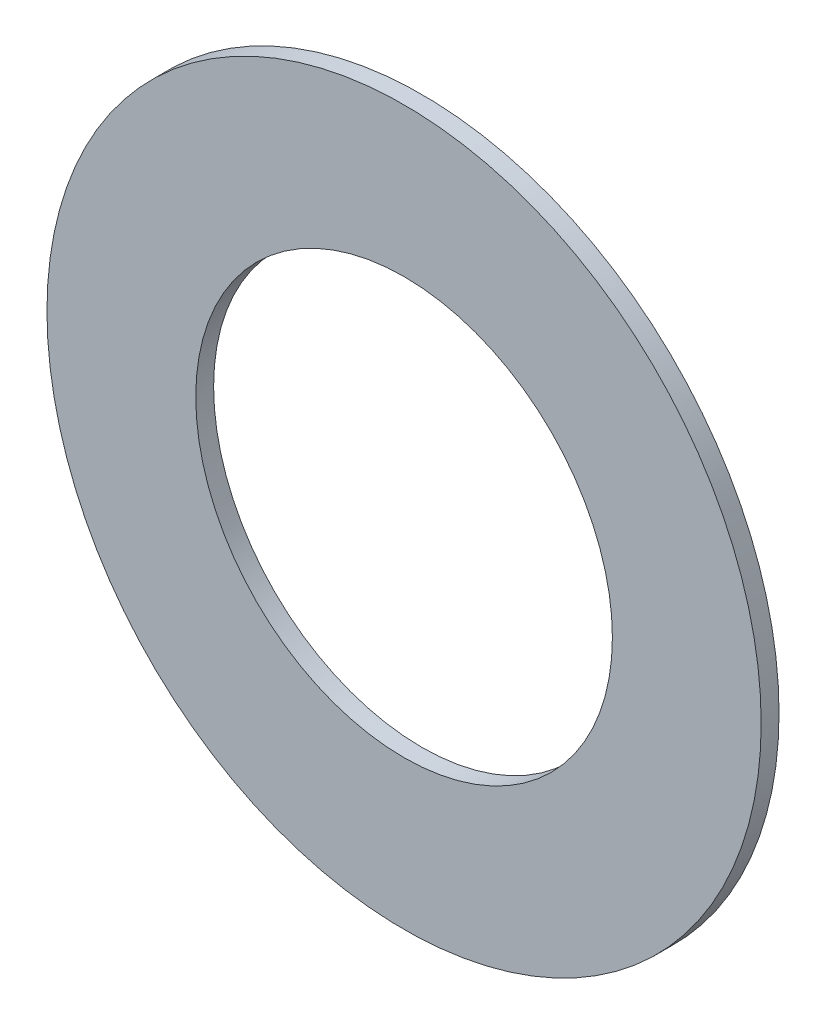
ISO-10303-21;
HEADER;
FILE_DESCRIPTION(('STEP AP214'),'2;1');
FILE_NAME('part.step','',(''),(''),'','','');
FILE_SCHEMA(('AUTOMOTIVE_DESIGN { 1 0 10303 214 1 1 1 1 }'));
ENDSEC;
DATA;
#1=APPLICATION_CONTEXT('core data for automotive mechanical design processes');
#2=APPLICATION_PROTOCOL_DEFINITION('international standard','automotive_design',2000,#1);
#3=PRODUCT_CONTEXT('',#1,'mechanical');
#4=PRODUCT('Part','Part','',(#3));
#5=PRODUCT_RELATED_PRODUCT_CATEGORY('part','',(#4));
#6=PRODUCT_DEFINITION_FORMATION('','',#4);
#7=PRODUCT_DEFINITION_CONTEXT('part definition',#1,'design');
#8=PRODUCT_DEFINITION('design','',#6,#7);
#9=PRODUCT_DEFINITION_SHAPE('','',#8);
#10=(LENGTH_UNIT() NAMED_UNIT(*) SI_UNIT(.MILLI.,.METRE.));
#11=(NAMED_UNIT(*) PLANE_ANGLE_UNIT() SI_UNIT($,.RADIAN.));
#12=(NAMED_UNIT(*) SI_UNIT($,.STERADIAN.) SOLID_ANGLE_UNIT());
#13=UNCERTAINTY_MEASURE_WITH_UNIT(LENGTH_MEASURE(1.E-05),#10,'distance_accuracy_value','');
#14=(GEOMETRIC_REPRESENTATION_CONTEXT(3) GLOBAL_UNCERTAINTY_ASSIGNED_CONTEXT((#13)) GLOBAL_UNIT_ASSIGNED_CONTEXT((#10,
#11,#12)) REPRESENTATION_CONTEXT('',''));
#15=CARTESIAN_POINT('',(0.,0.,0.));
#16=DIRECTION('',(0.,0.,1.));
#17=DIRECTION('',(1.,0.,0.));
#18=AXIS2_PLACEMENT_3D('',#15,#16,#17);
#19=CARTESIAN_POINT('',(0.,0.,0.3));
#20=DIRECTION('',(0.,0.,1.));
#21=DIRECTION('',(1.,0.,0.));
#22=AXIS2_PLACEMENT_3D('',#19,#20,#21);
#23=PLANE('',#22);
#24=CARTESIAN_POINT('',(0.,0.,0.3));
#25=DIRECTION('',(0.,0.,1.));
#26=DIRECTION('',(1.,0.,0.));
#27=AXIS2_PLACEMENT_3D('',#24,#25,#26);
#28=CIRCLE('',#27,6.);
#29=CARTESIAN_POINT('',(6.,0.,0.3));
#30=VERTEX_POINT('',#29);
#31=EDGE_CURVE('E10',#30,#30,#28,.T.);
#32=ORIENTED_EDGE('',*,*,#31,.T.);
#33=EDGE_LOOP('',(#32));
#34=FACE_BOUND('',#33,.T.);
#35=CARTESIAN_POINT('',(0.,0.,0.3));
#36=DIRECTION('',(0.,0.,1.));
#37=DIRECTION('',(1.,0.,0.));
#38=AXIS2_PLACEMENT_3D('',#35,#36,#37);
#39=CIRCLE('',#38,3.5);
#40=CARTESIAN_POINT('',(3.5,0.,0.3));
#41=VERTEX_POINT('',#40);
#42=EDGE_CURVE('E42',#41,#41,#39,.T.);
#43=ORIENTED_EDGE('',*,*,#42,.F.);
#44=EDGE_LOOP('',(#43));
#45=FACE_BOUND('',#44,.T.);
#46=ADVANCED_FACE('F31',(#34,#45),#23,.T.);
#47=CARTESIAN_POINT('',(0.,0.,0.));
#48=DIRECTION('',(0.,0.,1.));
#49=DIRECTION('',(1.,0.,0.));
#50=AXIS2_PLACEMENT_3D('',#47,#48,#49);
#51=PLANE('',#50);
#52=CARTESIAN_POINT('',(0.,0.,0.));
#53=DIRECTION('',(0.,0.,1.));
#54=DIRECTION('',(1.,0.,0.));
#55=AXIS2_PLACEMENT_3D('',#52,#53,#54);
#56=CIRCLE('',#55,6.);
#57=CARTESIAN_POINT('',(6.,0.,0.));
#58=VERTEX_POINT('',#57);
#59=EDGE_CURVE('E35',#58,#58,#56,.T.);
#60=ORIENTED_EDGE('',*,*,#59,.F.);
#61=EDGE_LOOP('',(#60));
#62=FACE_BOUND('',#61,.T.);
#63=CARTESIAN_POINT('',(0.,0.,0.));
#64=DIRECTION('',(0.,0.,1.));
#65=DIRECTION('',(1.,0.,0.));
#66=AXIS2_PLACEMENT_3D('',#63,#64,#65);
#67=CIRCLE('',#66,3.5);
#68=CARTESIAN_POINT('',(3.5,0.,0.));
#69=VERTEX_POINT('',#68);
#70=EDGE_CURVE('E44',#69,#69,#67,.T.);
#71=ORIENTED_EDGE('',*,*,#70,.T.);
#72=EDGE_LOOP('',(#71));
#73=FACE_BOUND('',#72,.T.);
#74=ADVANCED_FACE('F54',(#62,#73),#51,.F.);
#75=CARTESIAN_POINT('',(0.,0.,0.3));
#76=DIRECTION('',(0.,0.,-1.));
#77=DIRECTION('',(-1.,0.,0.));
#78=AXIS2_PLACEMENT_3D('',#75,#76,#77);
#79=CYLINDRICAL_SURFACE('',#78,6.);
#80=ORIENTED_EDGE('',*,*,#31,.F.);
#81=EDGE_LOOP('',(#80));
#82=FACE_BOUND('',#81,.T.);
#83=ORIENTED_EDGE('',*,*,#59,.T.);
#84=EDGE_LOOP('',(#83));
#85=FACE_BOUND('',#84,.T.);
#86=ADVANCED_FACE('F33',(#82,#85),#79,.T.);
#87=CARTESIAN_POINT('',(0.,0.,0.3));
#88=DIRECTION('',(0.,0.,-1.));
#89=DIRECTION('',(-1.,0.,0.));
#90=AXIS2_PLACEMENT_3D('',#87,#88,#89);
#91=CYLINDRICAL_SURFACE('',#90,3.5);
#92=ORIENTED_EDGE('',*,*,#42,.T.);
#93=EDGE_LOOP('',(#92));
#94=FACE_BOUND('',#93,.T.);
#95=ORIENTED_EDGE('',*,*,#70,.F.);
#96=EDGE_LOOP('',(#95));
#97=FACE_BOUND('',#96,.T.);
#98=ADVANCED_FACE('F50',(#94,#97),#91,.F.);
#99=CLOSED_SHELL('',(#46,#74,#86,#98));
#100=MANIFOLD_SOLID_BREP('B2',#99);
#101=ADVANCED_BREP_SHAPE_REPRESENTATION('',(#18,#100),#14);
#102=SHAPE_DEFINITION_REPRESENTATION(#9,#101);
ENDSEC;
END-ISO-10303-21;
